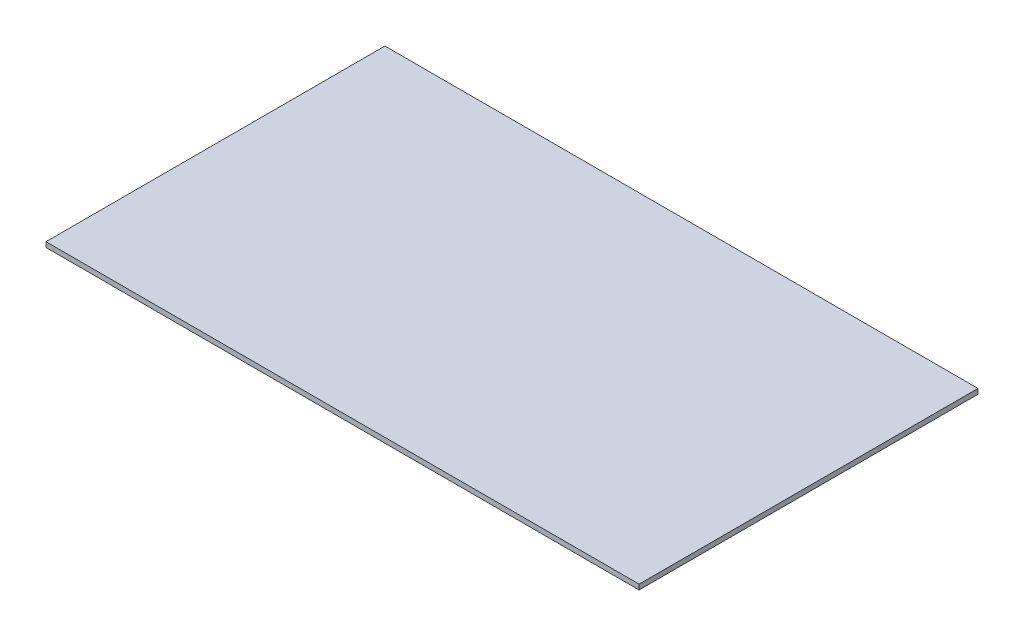
ISO-10303-21;
HEADER;
FILE_DESCRIPTION(('STEP AP214'),'2;1');
FILE_NAME('part.step','',(''),(''),'','','');
FILE_SCHEMA(('AUTOMOTIVE_DESIGN { 1 0 10303 214 1 1 1 1 }'));
ENDSEC;
DATA;
#1=APPLICATION_CONTEXT('core data for automotive mechanical design processes');
#2=APPLICATION_PROTOCOL_DEFINITION('international standard','automotive_design',2000,#1);
#3=PRODUCT_CONTEXT('',#1,'mechanical');
#4=PRODUCT('Part','Part','',(#3));
#5=PRODUCT_RELATED_PRODUCT_CATEGORY('part','',(#4));
#6=PRODUCT_DEFINITION_FORMATION('','',#4);
#7=PRODUCT_DEFINITION_CONTEXT('part definition',#1,'design');
#8=PRODUCT_DEFINITION('design','',#6,#7);
#9=PRODUCT_DEFINITION_SHAPE('','',#8);
#10=(LENGTH_UNIT() NAMED_UNIT(*) SI_UNIT(.MILLI.,.METRE.));
#11=(NAMED_UNIT(*) PLANE_ANGLE_UNIT() SI_UNIT($,.RADIAN.));
#12=(NAMED_UNIT(*) SI_UNIT($,.STERADIAN.) SOLID_ANGLE_UNIT());
#13=UNCERTAINTY_MEASURE_WITH_UNIT(LENGTH_MEASURE(1.E-05),#10,'distance_accuracy_value','');
#14=(GEOMETRIC_REPRESENTATION_CONTEXT(3) GLOBAL_UNCERTAINTY_ASSIGNED_CONTEXT((#13)) GLOBAL_UNIT_ASSIGNED_CONTEXT((#10,
#11,#12)) REPRESENTATION_CONTEXT('',''));
#15=CARTESIAN_POINT('',(0.,0.,0.));
#16=DIRECTION('',(0.,0.,1.));
#17=DIRECTION('',(1.,0.,0.));
#18=AXIS2_PLACEMENT_3D('',#15,#16,#17);
#19=CARTESIAN_POINT('',(0.,3.,0.));
#20=DIRECTION('',(1.,0.,0.));
#21=DIRECTION('',(0.,0.,-1.));
#22=AXIS2_PLACEMENT_3D('',#19,#20,#21);
#23=PLANE('',#22);
#24=DIRECTION('',(0.,0.,1.));
#25=VECTOR('',#24,1.);
#26=CARTESIAN_POINT('',(0.,0.,0.));
#27=LINE('',#26,#25);
#28=CARTESIAN_POINT('',(0.,0.,-200.));
#29=VERTEX_POINT('',#28);
#30=CARTESIAN_POINT('',(0.,0.,0.));
#31=VERTEX_POINT('',#30);
#32=EDGE_CURVE('E96',#29,#31,#27,.T.);
#33=ORIENTED_EDGE('',*,*,#32,.T.);
#34=DIRECTION('',(0.,-1.,0.));
#35=VECTOR('',#34,1.);
#36=CARTESIAN_POINT('',(0.,3.,0.));
#37=LINE('',#36,#35);
#38=CARTESIAN_POINT('',(0.,3.,0.));
#39=VERTEX_POINT('',#38);
#40=EDGE_CURVE('E11',#39,#31,#37,.T.);
#41=ORIENTED_EDGE('',*,*,#40,.F.);
#42=DIRECTION('',(0.,0.,1.));
#43=VECTOR('',#42,1.);
#44=CARTESIAN_POINT('',(0.,3.,0.));
#45=LINE('',#44,#43);
#46=CARTESIAN_POINT('',(0.,3.,-200.));
#47=VERTEX_POINT('',#46);
#48=EDGE_CURVE('E84',#47,#39,#45,.T.);
#49=ORIENTED_EDGE('',*,*,#48,.F.);
#50=DIRECTION('',(0.,-1.,0.));
#51=VECTOR('',#50,1.);
#52=CARTESIAN_POINT('',(0.,3.,-200.));
#53=LINE('',#52,#51);
#54=EDGE_CURVE('E92',#47,#29,#53,.T.);
#55=ORIENTED_EDGE('',*,*,#54,.T.);
#56=EDGE_LOOP('',(#33,#41,#49,#55));
#57=FACE_BOUND('',#56,.T.);
#58=ADVANCED_FACE('F33',(#57),#23,.F.);
#59=CARTESIAN_POINT('',(0.,3.,0.));
#60=DIRECTION('',(0.,0.,-1.));
#61=DIRECTION('',(-1.,0.,0.));
#62=AXIS2_PLACEMENT_3D('',#59,#60,#61);
#63=PLANE('',#62);
#64=DIRECTION('',(1.,0.,0.));
#65=VECTOR('',#64,1.);
#66=CARTESIAN_POINT('',(0.,0.,0.));
#67=LINE('',#66,#65);
#68=CARTESIAN_POINT('',(350.,0.,0.));
#69=VERTEX_POINT('',#68);
#70=EDGE_CURVE('E88',#31,#69,#67,.T.);
#71=ORIENTED_EDGE('',*,*,#70,.T.);
#72=DIRECTION('',(0.,-1.,0.));
#73=VECTOR('',#72,1.);
#74=CARTESIAN_POINT('',(350.,3.,0.));
#75=LINE('',#74,#73);
#76=CARTESIAN_POINT('',(350.,3.,0.));
#77=VERTEX_POINT('',#76);
#78=EDGE_CURVE('E41',#77,#69,#75,.T.);
#79=ORIENTED_EDGE('',*,*,#78,.F.);
#80=DIRECTION('',(1.,0.,0.));
#81=VECTOR('',#80,1.);
#82=CARTESIAN_POINT('',(0.,3.,0.));
#83=LINE('',#82,#81);
#84=EDGE_CURVE('E79',#39,#77,#83,.T.);
#85=ORIENTED_EDGE('',*,*,#84,.F.);
#86=ORIENTED_EDGE('',*,*,#40,.T.);
#87=EDGE_LOOP('',(#71,#79,#85,#86));
#88=FACE_BOUND('',#87,.T.);
#89=ADVANCED_FACE('F87',(#88),#63,.F.);
#90=CARTESIAN_POINT('',(350.,3.,0.));
#91=DIRECTION('',(-1.,0.,0.));
#92=DIRECTION('',(0.,0.,1.));
#93=AXIS2_PLACEMENT_3D('',#90,#91,#92);
#94=PLANE('',#93);
#95=DIRECTION('',(0.,0.,-1.));
#96=VECTOR('',#95,1.);
#97=CARTESIAN_POINT('',(350.,0.,0.));
#98=LINE('',#97,#96);
#99=CARTESIAN_POINT('',(350.,0.,-200.));
#100=VERTEX_POINT('',#99);
#101=EDGE_CURVE('E66',#69,#100,#98,.T.);
#102=ORIENTED_EDGE('',*,*,#101,.T.);
#103=DIRECTION('',(0.,-1.,0.));
#104=VECTOR('',#103,1.);
#105=CARTESIAN_POINT('',(350.,3.,-200.));
#106=LINE('',#105,#104);
#107=CARTESIAN_POINT('',(350.,3.,-200.));
#108=VERTEX_POINT('',#107);
#109=EDGE_CURVE('E89',#108,#100,#106,.T.);
#110=ORIENTED_EDGE('',*,*,#109,.F.);
#111=DIRECTION('',(0.,0.,-1.));
#112=VECTOR('',#111,1.);
#113=CARTESIAN_POINT('',(350.,3.,0.));
#114=LINE('',#113,#112);
#115=EDGE_CURVE('E82',#77,#108,#114,.T.);
#116=ORIENTED_EDGE('',*,*,#115,.F.);
#117=ORIENTED_EDGE('',*,*,#78,.T.);
#118=EDGE_LOOP('',(#102,#110,#116,#117));
#119=FACE_BOUND('',#118,.T.);
#120=ADVANCED_FACE('F90',(#119),#94,.F.);
#121=CARTESIAN_POINT('',(0.,3.,-200.));
#122=DIRECTION('',(0.,0.,1.));
#123=DIRECTION('',(1.,0.,0.));
#124=AXIS2_PLACEMENT_3D('',#121,#122,#123);
#125=PLANE('',#124);
#126=DIRECTION('',(-1.,0.,0.));
#127=VECTOR('',#126,1.);
#128=CARTESIAN_POINT('',(0.,0.,-200.));
#129=LINE('',#128,#127);
#130=EDGE_CURVE('E72',#100,#29,#129,.T.);
#131=ORIENTED_EDGE('',*,*,#130,.T.);
#132=ORIENTED_EDGE('',*,*,#54,.F.);
#133=DIRECTION('',(-1.,0.,0.));
#134=VECTOR('',#133,1.);
#135=CARTESIAN_POINT('',(0.,3.,-200.));
#136=LINE('',#135,#134);
#137=EDGE_CURVE('E49',#108,#47,#136,.T.);
#138=ORIENTED_EDGE('',*,*,#137,.F.);
#139=ORIENTED_EDGE('',*,*,#109,.T.);
#140=EDGE_LOOP('',(#131,#132,#138,#139));
#141=FACE_BOUND('',#140,.T.);
#142=ADVANCED_FACE('F103',(#141),#125,.F.);
#143=CARTESIAN_POINT('',(0.,3.,0.));
#144=DIRECTION('',(0.,-1.,0.));
#145=DIRECTION('',(0.,0.,-1.));
#146=AXIS2_PLACEMENT_3D('',#143,#144,#145);
#147=PLANE('',#146);
#148=ORIENTED_EDGE('',*,*,#48,.T.);
#149=ORIENTED_EDGE('',*,*,#84,.T.);
#150=ORIENTED_EDGE('',*,*,#115,.T.);
#151=ORIENTED_EDGE('',*,*,#137,.T.);
#152=EDGE_LOOP('',(#148,#149,#150,#151));
#153=FACE_BOUND('',#152,.T.);
#154=ADVANCED_FACE('F80',(#153),#147,.F.);
#155=CARTESIAN_POINT('',(0.,0.,0.));
#156=DIRECTION('',(0.,-1.,0.));
#157=DIRECTION('',(0.,0.,-1.));
#158=AXIS2_PLACEMENT_3D('',#155,#156,#157);
#159=PLANE('',#158);
#160=ORIENTED_EDGE('',*,*,#32,.F.);
#161=ORIENTED_EDGE('',*,*,#130,.F.);
#162=ORIENTED_EDGE('',*,*,#101,.F.);
#163=ORIENTED_EDGE('',*,*,#70,.F.);
#164=EDGE_LOOP('',(#160,#161,#162,#163));
#165=FACE_BOUND('',#164,.T.);
#166=ADVANCED_FACE('F106',(#165),#159,.T.);
#167=CLOSED_SHELL('',(#58,#89,#120,#142,#154,#166));
#168=MANIFOLD_SOLID_BREP('B2',#167);
#169=ADVANCED_BREP_SHAPE_REPRESENTATION('',(#18,#168),#14);
#170=SHAPE_DEFINITION_REPRESENTATION(#9,#169);
ENDSEC;
END-ISO-10303-21;
